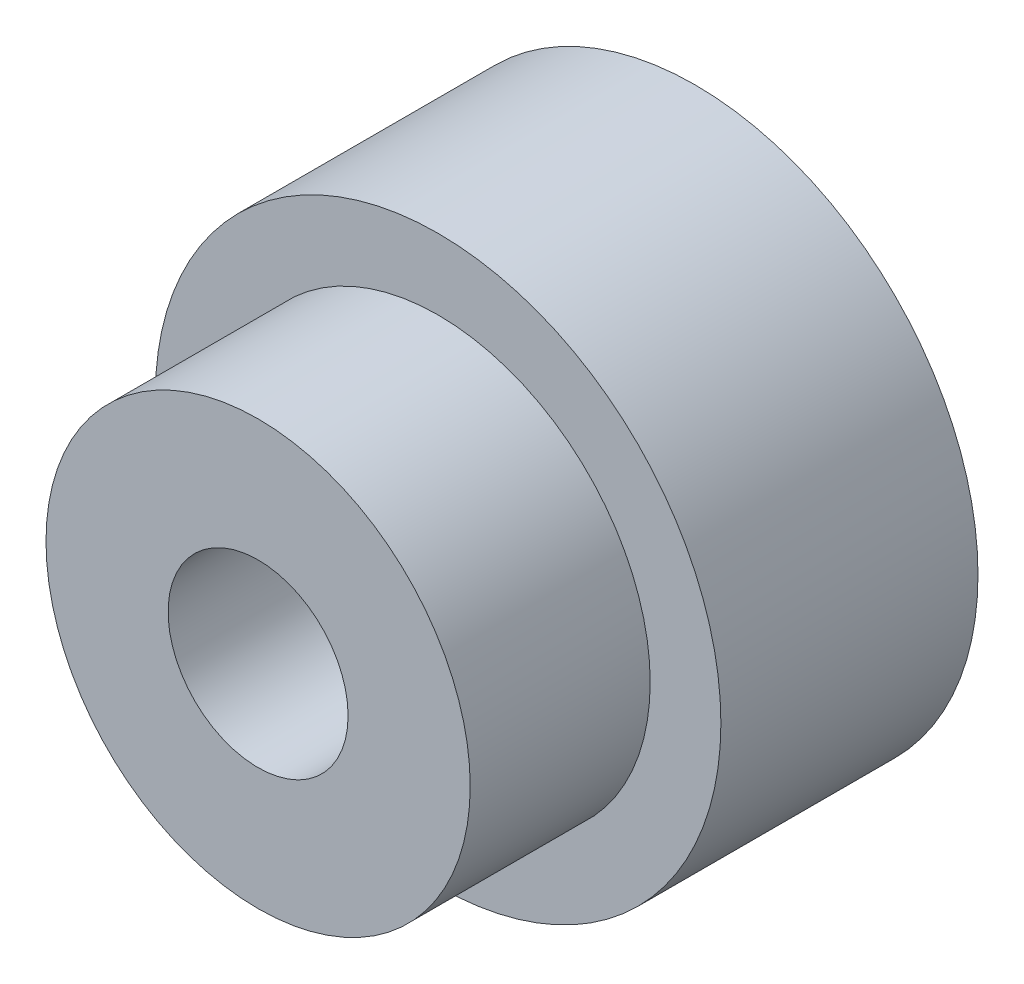
ISO-10303-21;
HEADER;
FILE_DESCRIPTION(('STEP AP214'),'2;1');
FILE_NAME('part.step','',(''),(''),'','','');
FILE_SCHEMA(('AUTOMOTIVE_DESIGN { 1 0 10303 214 1 1 1 1 }'));
ENDSEC;
DATA;
#1=APPLICATION_CONTEXT('core data for automotive mechanical design processes');
#2=APPLICATION_PROTOCOL_DEFINITION('international standard','automotive_design',2000,#1);
#3=PRODUCT_CONTEXT('',#1,'mechanical');
#4=PRODUCT('Part','Part','',(#3));
#5=PRODUCT_RELATED_PRODUCT_CATEGORY('part','',(#4));
#6=PRODUCT_DEFINITION_FORMATION('','',#4);
#7=PRODUCT_DEFINITION_CONTEXT('part definition',#1,'design');
#8=PRODUCT_DEFINITION('design','',#6,#7);
#9=PRODUCT_DEFINITION_SHAPE('','',#8);
#10=(LENGTH_UNIT() NAMED_UNIT(*) SI_UNIT(.MILLI.,.METRE.));
#11=(NAMED_UNIT(*) PLANE_ANGLE_UNIT() SI_UNIT($,.RADIAN.));
#12=(NAMED_UNIT(*) SI_UNIT($,.STERADIAN.) SOLID_ANGLE_UNIT());
#13=UNCERTAINTY_MEASURE_WITH_UNIT(LENGTH_MEASURE(1.E-05),#10,'distance_accuracy_value','');
#14=(GEOMETRIC_REPRESENTATION_CONTEXT(3) GLOBAL_UNCERTAINTY_ASSIGNED_CONTEXT((#13)) GLOBAL_UNIT_ASSIGNED_CONTEXT((#10,
#11,#12)) REPRESENTATION_CONTEXT('',''));
#15=CARTESIAN_POINT('',(0.,0.,0.));
#16=DIRECTION('',(0.,0.,1.));
#17=DIRECTION('',(1.,0.,0.));
#18=AXIS2_PLACEMENT_3D('',#15,#16,#17);
#19=CARTESIAN_POINT('',(0.,0.,20.));
#20=DIRECTION('',(0.,0.,-1.));
#21=DIRECTION('',(-1.,0.,0.));
#22=AXIS2_PLACEMENT_3D('',#19,#20,#21);
#23=CYLINDRICAL_SURFACE('',#22,22.);
#24=CARTESIAN_POINT('',(0.,0.,20.));
#25=DIRECTION('',(0.,0.,1.));
#26=DIRECTION('',(1.,0.,0.));
#27=AXIS2_PLACEMENT_3D('',#24,#25,#26);
#28=CIRCLE('',#27,22.);
#29=CARTESIAN_POINT('',(22.,0.,20.));
#30=VERTEX_POINT('',#29);
#31=EDGE_CURVE('E10',#30,#30,#28,.T.);
#32=ORIENTED_EDGE('',*,*,#31,.F.);
#33=EDGE_LOOP('',(#32));
#34=FACE_BOUND('',#33,.T.);
#35=CARTESIAN_POINT('',(0.,0.,0.));
#36=DIRECTION('',(0.,0.,1.));
#37=DIRECTION('',(1.,0.,0.));
#38=AXIS2_PLACEMENT_3D('',#35,#36,#37);
#39=CIRCLE('',#38,22.);
#40=CARTESIAN_POINT('',(22.,0.,0.));
#41=VERTEX_POINT('',#40);
#42=EDGE_CURVE('E36',#41,#41,#39,.T.);
#43=ORIENTED_EDGE('',*,*,#42,.T.);
#44=EDGE_LOOP('',(#43));
#45=FACE_BOUND('',#44,.T.);
#46=ADVANCED_FACE('F33',(#34,#45),#23,.T.);
#47=CARTESIAN_POINT('',(0.,0.,20.));
#48=DIRECTION('',(0.,0.,1.));
#49=DIRECTION('',(1.,0.,0.));
#50=AXIS2_PLACEMENT_3D('',#47,#48,#49);
#51=PLANE('',#50);
#52=CARTESIAN_POINT('',(0.,0.,20.));
#53=DIRECTION('',(0.,0.,1.));
#54=DIRECTION('',(1.,0.,0.));
#55=AXIS2_PLACEMENT_3D('',#52,#53,#54);
#56=CIRCLE('',#55,16.5);
#57=CARTESIAN_POINT('',(16.5,0.,20.));
#58=VERTEX_POINT('',#57);
#59=EDGE_CURVE('E45',#58,#58,#56,.T.);
#60=ORIENTED_EDGE('',*,*,#59,.F.);
#61=EDGE_LOOP('',(#60));
#62=FACE_BOUND('',#61,.T.);
#63=ORIENTED_EDGE('',*,*,#31,.T.);
#64=EDGE_LOOP('',(#63));
#65=FACE_BOUND('',#64,.T.);
#66=ADVANCED_FACE('F73',(#62,#65),#51,.T.);
#67=CARTESIAN_POINT('',(0.,0.,0.));
#68=DIRECTION('',(0.,0.,1.));
#69=DIRECTION('',(1.,0.,0.));
#70=AXIS2_PLACEMENT_3D('',#67,#68,#69);
#71=PLANE('',#70);
#72=CARTESIAN_POINT('',(0.,0.,0.));
#73=DIRECTION('',(0.,0.,1.));
#74=DIRECTION('',(1.,0.,0.));
#75=AXIS2_PLACEMENT_3D('',#72,#73,#74);
#76=CIRCLE('',#75,7.);
#77=CARTESIAN_POINT('',(7.,0.,0.));
#78=VERTEX_POINT('',#77);
#79=EDGE_CURVE('E48',#78,#78,#76,.T.);
#80=ORIENTED_EDGE('',*,*,#79,.T.);
#81=EDGE_LOOP('',(#80));
#82=FACE_BOUND('',#81,.T.);
#83=ORIENTED_EDGE('',*,*,#42,.F.);
#84=EDGE_LOOP('',(#83));
#85=FACE_BOUND('',#84,.T.);
#86=ADVANCED_FACE('F69',(#82,#85),#71,.F.);
#87=CARTESIAN_POINT('',(0.,0.,34.));
#88=DIRECTION('',(0.,0.,-1.));
#89=DIRECTION('',(-1.,0.,0.));
#90=AXIS2_PLACEMENT_3D('',#87,#88,#89);
#91=CYLINDRICAL_SURFACE('',#90,16.5);
#92=CARTESIAN_POINT('',(0.,0.,34.));
#93=DIRECTION('',(0.,0.,1.));
#94=DIRECTION('',(1.,0.,0.));
#95=AXIS2_PLACEMENT_3D('',#92,#93,#94);
#96=CIRCLE('',#95,16.5);
#97=CARTESIAN_POINT('',(16.5,0.,34.));
#98=VERTEX_POINT('',#97);
#99=EDGE_CURVE('E43',#98,#98,#96,.T.);
#100=ORIENTED_EDGE('',*,*,#99,.F.);
#101=EDGE_LOOP('',(#100));
#102=FACE_BOUND('',#101,.T.);
#103=ORIENTED_EDGE('',*,*,#59,.T.);
#104=EDGE_LOOP('',(#103));
#105=FACE_BOUND('',#104,.T.);
#106=ADVANCED_FACE('F63',(#102,#105),#91,.T.);
#107=CARTESIAN_POINT('',(0.,0.,34.));
#108=DIRECTION('',(0.,0.,1.));
#109=DIRECTION('',(1.,0.,0.));
#110=AXIS2_PLACEMENT_3D('',#107,#108,#109);
#111=PLANE('',#110);
#112=CARTESIAN_POINT('',(0.,0.,34.));
#113=DIRECTION('',(0.,0.,1.));
#114=DIRECTION('',(1.,0.,0.));
#115=AXIS2_PLACEMENT_3D('',#112,#113,#114);
#116=CIRCLE('',#115,7.);
#117=CARTESIAN_POINT('',(7.,0.,34.));
#118=VERTEX_POINT('',#117);
#119=EDGE_CURVE('E53',#118,#118,#116,.T.);
#120=ORIENTED_EDGE('',*,*,#119,.F.);
#121=EDGE_LOOP('',(#120));
#122=FACE_BOUND('',#121,.T.);
#123=ORIENTED_EDGE('',*,*,#99,.T.);
#124=EDGE_LOOP('',(#123));
#125=FACE_BOUND('',#124,.T.);
#126=ADVANCED_FACE('F60',(#122,#125),#111,.T.);
#127=CARTESIAN_POINT('',(0.,0.,-60.8));
#128=DIRECTION('',(0.,0.,1.));
#129=DIRECTION('',(1.,0.,0.));
#130=AXIS2_PLACEMENT_3D('',#127,#128,#129);
#131=CYLINDRICAL_SURFACE('',#130,7.);
#132=ORIENTED_EDGE('',*,*,#119,.T.);
#133=EDGE_LOOP('',(#132));
#134=FACE_BOUND('',#133,.T.);
#135=ORIENTED_EDGE('',*,*,#79,.F.);
#136=EDGE_LOOP('',(#135));
#137=FACE_BOUND('',#136,.T.);
#138=ADVANCED_FACE('F57',(#134,#137),#131,.F.);
#139=CLOSED_SHELL('',(#46,#66,#86,#106,#126,#138));
#140=MANIFOLD_SOLID_BREP('B2',#139);
#141=ADVANCED_BREP_SHAPE_REPRESENTATION('',(#18,#140),#14);
#142=SHAPE_DEFINITION_REPRESENTATION(#9,#141);
ENDSEC;
END-ISO-10303-21;
